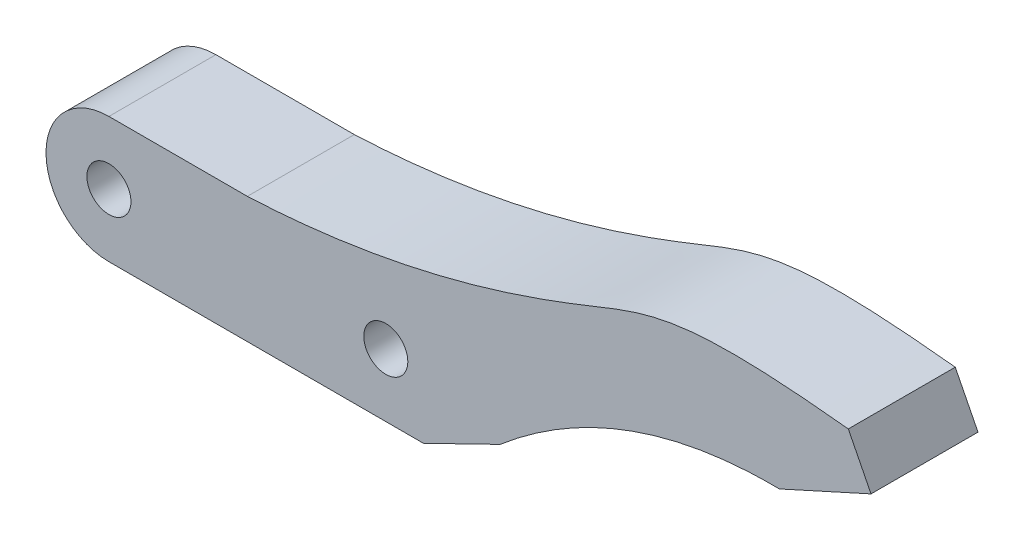
ISO-10303-21;
HEADER;
FILE_DESCRIPTION(('STEP AP214'),'2;1');
FILE_NAME('part.step','',(''),(''),'','','');
FILE_SCHEMA(('AUTOMOTIVE_DESIGN { 1 0 10303 214 1 1 1 1 }'));
ENDSEC;
DATA;
#1=APPLICATION_CONTEXT('core data for automotive mechanical design processes');
#2=APPLICATION_PROTOCOL_DEFINITION('international standard','automotive_design',2000,#1);
#3=PRODUCT_CONTEXT('',#1,'mechanical');
#4=PRODUCT('Part','Part','',(#3));
#5=PRODUCT_RELATED_PRODUCT_CATEGORY('part','',(#4));
#6=PRODUCT_DEFINITION_FORMATION('','',#4);
#7=PRODUCT_DEFINITION_CONTEXT('part definition',#1,'design');
#8=PRODUCT_DEFINITION('design','',#6,#7);
#9=PRODUCT_DEFINITION_SHAPE('','',#8);
#10=(LENGTH_UNIT() NAMED_UNIT(*) SI_UNIT(.MILLI.,.METRE.));
#11=(NAMED_UNIT(*) PLANE_ANGLE_UNIT() SI_UNIT($,.RADIAN.));
#12=(NAMED_UNIT(*) SI_UNIT($,.STERADIAN.) SOLID_ANGLE_UNIT());
#13=UNCERTAINTY_MEASURE_WITH_UNIT(LENGTH_MEASURE(1.E-05),#10,'distance_accuracy_value','');
#14=(GEOMETRIC_REPRESENTATION_CONTEXT(3) GLOBAL_UNCERTAINTY_ASSIGNED_CONTEXT((#13)) GLOBAL_UNIT_ASSIGNED_CONTEXT((#10,
#11,#12)) REPRESENTATION_CONTEXT('',''));
#15=CARTESIAN_POINT('',(0.,0.,0.));
#16=DIRECTION('',(0.,0.,1.));
#17=DIRECTION('',(1.,0.,0.));
#18=AXIS2_PLACEMENT_3D('',#15,#16,#17);
#19=CARTESIAN_POINT('',(0.,-5.,8.5));
#20=DIRECTION('',(0.,1.,0.));
#21=DIRECTION('',(0.,0.,1.));
#22=AXIS2_PLACEMENT_3D('',#19,#20,#21);
#23=PLANE('',#22);
#24=DIRECTION('',(1.,0.,0.));
#25=VECTOR('',#24,1.);
#26=CARTESIAN_POINT('',(0.,-5.,0.));
#27=LINE('',#26,#25);
#28=CARTESIAN_POINT('',(0.,-5.,0.));
#29=VERTEX_POINT('',#28);
#30=CARTESIAN_POINT('',(24.99,-5.,0.));
#31=VERTEX_POINT('',#30);
#32=EDGE_CURVE('E110',#29,#31,#27,.T.);
#33=ORIENTED_EDGE('',*,*,#32,.T.);
#34=DIRECTION('',(0.,0.,1.));
#35=VECTOR('',#34,1.);
#36=CARTESIAN_POINT('',(24.99,-5.,0.));
#37=LINE('',#36,#35);
#38=CARTESIAN_POINT('',(24.99,-5.,8.5));
#39=VERTEX_POINT('',#38);
#40=EDGE_CURVE('E162',#31,#39,#37,.T.);
#41=ORIENTED_EDGE('',*,*,#40,.T.);
#42=DIRECTION('',(1.,0.,0.));
#43=VECTOR('',#42,1.);
#44=CARTESIAN_POINT('',(0.,-5.,8.5));
#45=LINE('',#44,#43);
#46=CARTESIAN_POINT('',(0.,-5.,8.5));
#47=VERTEX_POINT('',#46);
#48=EDGE_CURVE('E229',#47,#39,#45,.T.);
#49=ORIENTED_EDGE('',*,*,#48,.F.);
#50=DIRECTION('',(0.,0.,-1.));
#51=VECTOR('',#50,1.);
#52=CARTESIAN_POINT('',(0.,-5.,8.5));
#53=LINE('',#52,#51);
#54=EDGE_CURVE('E54',#47,#29,#53,.T.);
#55=ORIENTED_EDGE('',*,*,#54,.T.);
#56=EDGE_LOOP('',(#33,#41,#49,#55));
#57=FACE_BOUND('',#56,.T.);
#58=ADVANCED_FACE('F45',(#57),#23,.F.);
#59=CARTESIAN_POINT('',(0.,5.,8.5));
#60=DIRECTION('',(0.,1.,0.));
#61=DIRECTION('',(0.,0.,1.));
#62=AXIS2_PLACEMENT_3D('',#59,#60,#61);
#63=PLANE('',#62);
#64=DIRECTION('',(0.,0.,1.));
#65=VECTOR('',#64,1.);
#66=CARTESIAN_POINT('',(11.,5.,0.));
#67=LINE('',#66,#65);
#68=CARTESIAN_POINT('',(11.,5.,0.));
#69=VERTEX_POINT('',#68);
#70=CARTESIAN_POINT('',(11.,5.,8.5));
#71=VERTEX_POINT('',#70);
#72=EDGE_CURVE('E101',#69,#71,#67,.T.);
#73=ORIENTED_EDGE('',*,*,#72,.F.);
#74=DIRECTION('',(1.,0.,0.));
#75=VECTOR('',#74,1.);
#76=CARTESIAN_POINT('',(0.,5.,0.));
#77=LINE('',#76,#75);
#78=CARTESIAN_POINT('',(0.,5.,0.));
#79=VERTEX_POINT('',#78);
#80=EDGE_CURVE('E209',#79,#69,#77,.T.);
#81=ORIENTED_EDGE('',*,*,#80,.F.);
#82=DIRECTION('',(0.,0.,-1.));
#83=VECTOR('',#82,1.);
#84=CARTESIAN_POINT('',(0.,5.,8.5));
#85=LINE('',#84,#83);
#86=CARTESIAN_POINT('',(0.,5.,8.5));
#87=VERTEX_POINT('',#86);
#88=EDGE_CURVE('E11',#87,#79,#85,.T.);
#89=ORIENTED_EDGE('',*,*,#88,.F.);
#90=DIRECTION('',(1.,0.,0.));
#91=VECTOR('',#90,1.);
#92=CARTESIAN_POINT('',(0.,5.,8.5));
#93=LINE('',#92,#91);
#94=EDGE_CURVE('E210',#87,#71,#93,.T.);
#95=ORIENTED_EDGE('',*,*,#94,.T.);
#96=EDGE_LOOP('',(#73,#81,#89,#95));
#97=FACE_BOUND('',#96,.T.);
#98=ADVANCED_FACE('F197',(#97),#63,.T.);
#99=CARTESIAN_POINT('',(0.,0.,8.5));
#100=DIRECTION('',(0.,0.,-1.));
#101=DIRECTION('',(-1.,0.,0.));
#102=AXIS2_PLACEMENT_3D('',#99,#100,#101);
#103=CYLINDRICAL_SURFACE('',#102,1.75);
#104=CARTESIAN_POINT('',(0.,0.,8.5));
#105=DIRECTION('',(0.,0.,1.));
#106=DIRECTION('',(1.,0.,0.));
#107=AXIS2_PLACEMENT_3D('',#104,#105,#106);
#108=CIRCLE('',#107,1.75);
#109=CARTESIAN_POINT('',(1.75,0.,8.5));
#110=VERTEX_POINT('',#109);
#111=EDGE_CURVE('E235',#110,#110,#108,.T.);
#112=ORIENTED_EDGE('',*,*,#111,.T.);
#113=EDGE_LOOP('',(#112));
#114=FACE_BOUND('',#113,.T.);
#115=CARTESIAN_POINT('',(0.,0.,0.));
#116=DIRECTION('',(0.,0.,1.));
#117=DIRECTION('',(1.,0.,0.));
#118=AXIS2_PLACEMENT_3D('',#115,#116,#117);
#119=CIRCLE('',#118,1.75);
#120=CARTESIAN_POINT('',(1.75,0.,0.));
#121=VERTEX_POINT('',#120);
#122=EDGE_CURVE('E218',#121,#121,#119,.T.);
#123=ORIENTED_EDGE('',*,*,#122,.F.);
#124=EDGE_LOOP('',(#123));
#125=FACE_BOUND('',#124,.T.);
#126=ADVANCED_FACE('F194',(#114,#125),#103,.F.);
#127=CARTESIAN_POINT('',(0.,0.,8.5));
#128=DIRECTION('',(0.,0.,-1.));
#129=DIRECTION('',(-1.,0.,0.));
#130=AXIS2_PLACEMENT_3D('',#127,#128,#129);
#131=CYLINDRICAL_SURFACE('',#130,5.);
#132=CARTESIAN_POINT('',(0.,0.,0.));
#133=DIRECTION('',(0.,0.,1.));
#134=DIRECTION('',(1.,0.,0.));
#135=AXIS2_PLACEMENT_3D('',#132,#133,#134);
#136=CIRCLE('',#135,5.);
#137=EDGE_CURVE('E213',#79,#29,#136,.T.);
#138=ORIENTED_EDGE('',*,*,#137,.T.);
#139=ORIENTED_EDGE('',*,*,#54,.F.);
#140=CARTESIAN_POINT('',(0.,0.,8.5));
#141=DIRECTION('',(0.,0.,1.));
#142=DIRECTION('',(1.,0.,0.));
#143=AXIS2_PLACEMENT_3D('',#140,#141,#142);
#144=CIRCLE('',#143,5.);
#145=EDGE_CURVE('E62',#87,#47,#144,.T.);
#146=ORIENTED_EDGE('',*,*,#145,.F.);
#147=ORIENTED_EDGE('',*,*,#88,.T.);
#148=EDGE_LOOP('',(#138,#139,#146,#147));
#149=FACE_BOUND('',#148,.T.);
#150=ADVANCED_FACE('F192',(#149),#131,.T.);
#151=CARTESIAN_POINT('',(22.,0.,8.5));
#152=DIRECTION('',(0.,0.,-1.));
#153=DIRECTION('',(-1.,0.,0.));
#154=AXIS2_PLACEMENT_3D('',#151,#152,#153);
#155=CYLINDRICAL_SURFACE('',#154,1.75);
#156=CARTESIAN_POINT('',(22.,0.,8.5));
#157=DIRECTION('',(0.,0.,1.));
#158=DIRECTION('',(1.,0.,0.));
#159=AXIS2_PLACEMENT_3D('',#156,#157,#158);
#160=CIRCLE('',#159,1.75);
#161=CARTESIAN_POINT('',(23.75,0.,8.5));
#162=VERTEX_POINT('',#161);
#163=EDGE_CURVE('E231',#162,#162,#160,.T.);
#164=ORIENTED_EDGE('',*,*,#163,.T.);
#165=EDGE_LOOP('',(#164));
#166=FACE_BOUND('',#165,.T.);
#167=CARTESIAN_POINT('',(22.,0.,0.));
#168=DIRECTION('',(0.,0.,1.));
#169=DIRECTION('',(1.,0.,0.));
#170=AXIS2_PLACEMENT_3D('',#167,#168,#169);
#171=CIRCLE('',#170,1.75);
#172=CARTESIAN_POINT('',(23.75,0.,0.));
#173=VERTEX_POINT('',#172);
#174=EDGE_CURVE('E226',#173,#173,#171,.T.);
#175=ORIENTED_EDGE('',*,*,#174,.F.);
#176=EDGE_LOOP('',(#175));
#177=FACE_BOUND('',#176,.T.);
#178=ADVANCED_FACE('F187',(#166,#177),#155,.F.);
#179=CARTESIAN_POINT('',(0.,0.,8.5));
#180=DIRECTION('',(0.,0.,1.));
#181=DIRECTION('',(1.,0.,0.));
#182=AXIS2_PLACEMENT_3D('',#179,#180,#181);
#183=PLANE('',#182);
#184=ORIENTED_EDGE('',*,*,#48,.T.);
#185=DIRECTION('',(0.898794046299166,0.438371146789079,0.));
#186=VECTOR('',#185,1.);
#187=CARTESIAN_POINT('',(24.99,-5.,8.5));
#188=LINE('',#187,#186);
#189=CARTESIAN_POINT('',(31.08,-2.02970853563389,8.5));
#190=VERTEX_POINT('',#189);
#191=EDGE_CURVE('E163',#39,#190,#188,.T.);
#192=ORIENTED_EDGE('',*,*,#191,.T.);
#193=CARTESIAN_POINT('',(31.08,-2.02970853563389,8.5));
#194=CARTESIAN_POINT('',(40.7387234524963,6.18827081402431,8.5));
#195=CARTESIAN_POINT('',(53.27,6.,8.5));
#196=B_SPLINE_CURVE_WITH_KNOTS('',2,(#193,#194,#195),.UNSPECIFIED.,.F.,.F.,(3,3),(0.,1.),.UNSPECIFIED.);
#197=CARTESIAN_POINT('',(53.27,6.,8.5));
#198=VERTEX_POINT('',#197);
#199=EDGE_CURVE('E268',#190,#198,#196,.T.);
#200=ORIENTED_EDGE('',*,*,#199,.T.);
#201=DIRECTION('',(0.910876713981416,0.41267858186053,0.));
#202=VECTOR('',#201,1.);
#203=CARTESIAN_POINT('',(60.5570137118513,9.30142865488424,8.5));
#204=LINE('',#203,#202);
#205=CARTESIAN_POINT('',(60.5570137118513,9.30142865488424,8.5));
#206=VERTEX_POINT('',#205);
#207=EDGE_CURVE('E266',#198,#206,#204,.T.);
#208=ORIENTED_EDGE('',*,*,#207,.T.);
#209=DIRECTION('',(-0.451753427962833,0.892142836278939,0.));
#210=VECTOR('',#209,1.);
#211=CARTESIAN_POINT('',(58.75,12.87,8.5));
#212=LINE('',#211,#210);
#213=CARTESIAN_POINT('',(58.75,12.87,8.5));
#214=VERTEX_POINT('',#213);
#215=EDGE_CURVE('E126',#206,#214,#212,.T.);
#216=ORIENTED_EDGE('',*,*,#215,.T.);
#217=CARTESIAN_POINT('',(58.75,12.87,8.5));
#218=CARTESIAN_POINT('',(45.2454804493819,14.3222054253579,8.5));
#219=CARTESIAN_POINT('',(40.5808411827349,11.5038350963112,8.5));
#220=CARTESIAN_POINT('',(22.8336535263794,5.52322644781668,8.5));
#221=CARTESIAN_POINT('',(11.,5.,8.5));
#222=B_SPLINE_CURVE_WITH_KNOTS('',3,(#217,#218,#219,#220,#221),.UNSPECIFIED.,.F.,.F.,(4,1,4),
(0.,0.493101000743228,1.),.UNSPECIFIED.);
#223=EDGE_CURVE('E256',#214,#71,#222,.T.);
#224=ORIENTED_EDGE('',*,*,#223,.T.);
#225=ORIENTED_EDGE('',*,*,#94,.F.);
#226=ORIENTED_EDGE('',*,*,#145,.T.);
#227=EDGE_LOOP('',(#184,#192,#200,#208,#216,#224,#225,#226));
#228=FACE_BOUND('',#227,.T.);
#229=ORIENTED_EDGE('',*,*,#111,.F.);
#230=EDGE_LOOP('',(#229));
#231=FACE_BOUND('',#230,.T.);
#232=ORIENTED_EDGE('',*,*,#163,.F.);
#233=EDGE_LOOP('',(#232));
#234=FACE_BOUND('',#233,.T.);
#235=ADVANCED_FACE('F184',(#228,#231,#234),#183,.T.);
#236=CARTESIAN_POINT('',(0.,0.,0.));
#237=DIRECTION('',(0.,0.,1.));
#238=DIRECTION('',(1.,0.,0.));
#239=AXIS2_PLACEMENT_3D('',#236,#237,#238);
#240=PLANE('',#239);
#241=ORIENTED_EDGE('',*,*,#32,.F.);
#242=ORIENTED_EDGE('',*,*,#137,.F.);
#243=ORIENTED_EDGE('',*,*,#80,.T.);
#244=CARTESIAN_POINT('',(58.75,12.87,0.));
#245=CARTESIAN_POINT('',(45.2454804493819,14.3222054253579,0.));
#246=CARTESIAN_POINT('',(40.5808411827349,11.5038350963112,0.));
#247=CARTESIAN_POINT('',(22.8336535263794,5.52322644781668,0.));
#248=CARTESIAN_POINT('',(11.,5.,0.));
#249=B_SPLINE_CURVE_WITH_KNOTS('',3,(#244,#245,#246,#247,#248),.UNSPECIFIED.,.F.,.F.,(4,1,4),
(0.,0.493101000743228,1.),.UNSPECIFIED.);
#250=CARTESIAN_POINT('',(58.75,12.87,0.));
#251=VERTEX_POINT('',#250);
#252=EDGE_CURVE('E79',#251,#69,#249,.T.);
#253=ORIENTED_EDGE('',*,*,#252,.F.);
#254=DIRECTION('',(-0.451753427962833,0.892142836278939,0.));
#255=VECTOR('',#254,1.);
#256=CARTESIAN_POINT('',(58.75,12.87,0.));
#257=LINE('',#256,#255);
#258=CARTESIAN_POINT('',(60.5570137118513,9.30142865488424,0.));
#259=VERTEX_POINT('',#258);
#260=EDGE_CURVE('E124',#259,#251,#257,.T.);
#261=ORIENTED_EDGE('',*,*,#260,.F.);
#262=DIRECTION('',(0.910876713981416,0.41267858186053,0.));
#263=VECTOR('',#262,1.);
#264=CARTESIAN_POINT('',(60.5570137118513,9.30142865488424,0.));
#265=LINE('',#264,#263);
#266=CARTESIAN_POINT('',(53.27,6.,0.));
#267=VERTEX_POINT('',#266);
#268=EDGE_CURVE('E140',#267,#259,#265,.T.);
#269=ORIENTED_EDGE('',*,*,#268,.F.);
#270=CARTESIAN_POINT('',(31.08,-2.02970853563389,0.));
#271=CARTESIAN_POINT('',(40.7387234524963,6.18827081402431,0.));
#272=CARTESIAN_POINT('',(53.27,6.,0.));
#273=B_SPLINE_CURVE_WITH_KNOTS('',2,(#270,#271,#272),.UNSPECIFIED.,.F.,.F.,(3,3),(0.,1.),.UNSPECIFIED.);
#274=CARTESIAN_POINT('',(31.08,-2.02970853563389,0.));
#275=VERTEX_POINT('',#274);
#276=EDGE_CURVE('E147',#275,#267,#273,.T.);
#277=ORIENTED_EDGE('',*,*,#276,.F.);
#278=DIRECTION('',(0.898794046299166,0.438371146789079,0.));
#279=VECTOR('',#278,1.);
#280=CARTESIAN_POINT('',(24.99,-5.,0.));
#281=LINE('',#280,#279);
#282=EDGE_CURVE('E150',#31,#275,#281,.T.);
#283=ORIENTED_EDGE('',*,*,#282,.F.);
#284=EDGE_LOOP('',(#241,#242,#243,#253,#261,#269,#277,#283));
#285=FACE_BOUND('',#284,.T.);
#286=ORIENTED_EDGE('',*,*,#122,.T.);
#287=EDGE_LOOP('',(#286));
#288=FACE_BOUND('',#287,.T.);
#289=ORIENTED_EDGE('',*,*,#174,.T.);
#290=EDGE_LOOP('',(#289));
#291=FACE_BOUND('',#290,.T.);
#292=ADVANCED_FACE('F137',(#285,#288,#291),#240,.F.);
#293=DIRECTION('',(0.,0.,1.));
#294=VECTOR('',#293,1.);
#295=SURFACE_OF_LINEAR_EXTRUSION('',#249,#294);
#296=ORIENTED_EDGE('',*,*,#223,.F.);
#297=DIRECTION('',(0.,0.,1.));
#298=VECTOR('',#297,1.);
#299=CARTESIAN_POINT('',(58.75,12.87,0.));
#300=LINE('',#299,#298);
#301=EDGE_CURVE('E132',#251,#214,#300,.T.);
#302=ORIENTED_EDGE('',*,*,#301,.F.);
#303=ORIENTED_EDGE('',*,*,#252,.T.);
#304=ORIENTED_EDGE('',*,*,#72,.T.);
#305=EDGE_LOOP('',(#296,#302,#303,#304));
#306=FACE_BOUND('',#305,.T.);
#307=ADVANCED_FACE('F169',(#306),#295,.T.);
#308=CARTESIAN_POINT('',(58.75,12.87,0.));
#309=DIRECTION('',(0.892142836278939,0.451753427962833,0.));
#310=DIRECTION('',(-0.451753427962833,0.892142836278939,0.));
#311=AXIS2_PLACEMENT_3D('',#308,#309,#310);
#312=PLANE('',#311);
#313=ORIENTED_EDGE('',*,*,#215,.F.);
#314=DIRECTION('',(0.,0.,1.));
#315=VECTOR('',#314,1.);
#316=CARTESIAN_POINT('',(60.5570137118513,9.30142865488424,0.));
#317=LINE('',#316,#315);
#318=EDGE_CURVE('E121',#259,#206,#317,.T.);
#319=ORIENTED_EDGE('',*,*,#318,.F.);
#320=ORIENTED_EDGE('',*,*,#260,.T.);
#321=ORIENTED_EDGE('',*,*,#301,.T.);
#322=EDGE_LOOP('',(#313,#319,#320,#321));
#323=FACE_BOUND('',#322,.T.);
#324=ADVANCED_FACE('F123',(#323),#312,.T.);
#325=CARTESIAN_POINT('',(60.5570137118513,9.30142865488424,0.));
#326=DIRECTION('',(0.41267858186053,-0.910876713981416,0.));
#327=DIRECTION('',(0.910876713981416,0.41267858186053,0.));
#328=AXIS2_PLACEMENT_3D('',#325,#326,#327);
#329=PLANE('',#328);
#330=ORIENTED_EDGE('',*,*,#207,.F.);
#331=DIRECTION('',(0.,0.,1.));
#332=VECTOR('',#331,1.);
#333=CARTESIAN_POINT('',(53.27,6.,0.));
#334=LINE('',#333,#332);
#335=EDGE_CURVE('E133',#267,#198,#334,.T.);
#336=ORIENTED_EDGE('',*,*,#335,.F.);
#337=ORIENTED_EDGE('',*,*,#268,.T.);
#338=ORIENTED_EDGE('',*,*,#318,.T.);
#339=EDGE_LOOP('',(#330,#336,#337,#338));
#340=FACE_BOUND('',#339,.T.);
#341=ADVANCED_FACE('F145',(#340),#329,.T.);
#342=DIRECTION('',(0.,0.,1.));
#343=VECTOR('',#342,1.);
#344=SURFACE_OF_LINEAR_EXTRUSION('',#273,#343);
#345=ORIENTED_EDGE('',*,*,#199,.F.);
#346=DIRECTION('',(0.,0.,1.));
#347=VECTOR('',#346,1.);
#348=CARTESIAN_POINT('',(31.08,-2.02970853563389,0.));
#349=LINE('',#348,#347);
#350=EDGE_CURVE('E249',#275,#190,#349,.T.);
#351=ORIENTED_EDGE('',*,*,#350,.F.);
#352=ORIENTED_EDGE('',*,*,#276,.T.);
#353=ORIENTED_EDGE('',*,*,#335,.T.);
#354=EDGE_LOOP('',(#345,#351,#352,#353));
#355=FACE_BOUND('',#354,.T.);
#356=ADVANCED_FACE('F176',(#355),#344,.T.);
#357=CARTESIAN_POINT('',(24.99,-5.,0.));
#358=DIRECTION('',(0.438371146789079,-0.898794046299166,0.));
#359=DIRECTION('',(0.898794046299167,0.438371146789079,0.));
#360=AXIS2_PLACEMENT_3D('',#357,#358,#359);
#361=PLANE('',#360);
#362=ORIENTED_EDGE('',*,*,#191,.F.);
#363=ORIENTED_EDGE('',*,*,#40,.F.);
#364=ORIENTED_EDGE('',*,*,#282,.T.);
#365=ORIENTED_EDGE('',*,*,#350,.T.);
#366=EDGE_LOOP('',(#362,#363,#364,#365));
#367=FACE_BOUND('',#366,.T.);
#368=ADVANCED_FACE('F179',(#367),#361,.T.);
#369=CLOSED_SHELL('',(#58,#98,#126,#150,#178,#235,#292,#307,#324,#341,#356,#368));
#370=MANIFOLD_SOLID_BREP('B2',#369);
#371=ADVANCED_BREP_SHAPE_REPRESENTATION('',(#18,#370),#14);
#372=SHAPE_DEFINITION_REPRESENTATION(#9,#371);
ENDSEC;
END-ISO-10303-21;
